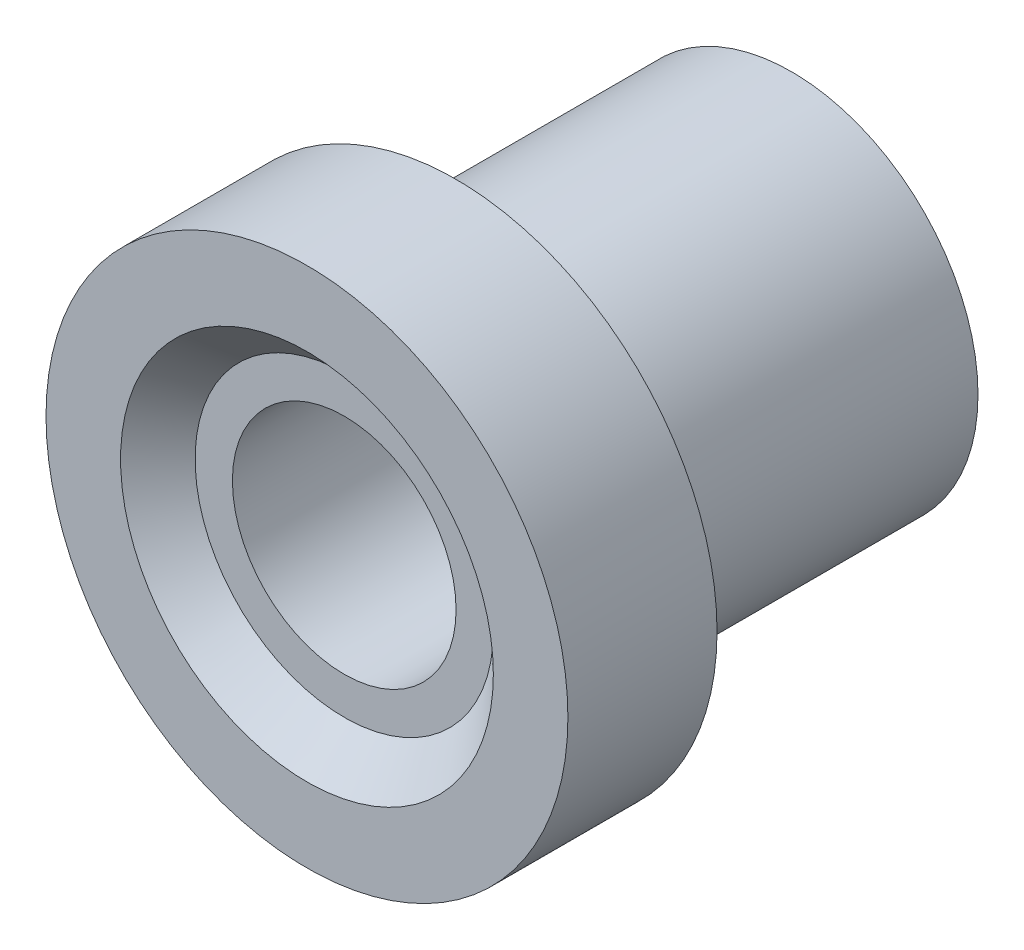
ISO-10303-21;
HEADER;
FILE_DESCRIPTION(('STEP AP214'),'2;1');
FILE_NAME('part.step','',(''),(''),'','','');
FILE_SCHEMA(('AUTOMOTIVE_DESIGN { 1 0 10303 214 1 1 1 1 }'));
ENDSEC;
DATA;
#1=APPLICATION_CONTEXT('core data for automotive mechanical design processes');
#2=APPLICATION_PROTOCOL_DEFINITION('international standard','automotive_design',2000,#1);
#3=PRODUCT_CONTEXT('',#1,'mechanical');
#4=PRODUCT('Part','Part','',(#3));
#5=PRODUCT_RELATED_PRODUCT_CATEGORY('part','',(#4));
#6=PRODUCT_DEFINITION_FORMATION('','',#4);
#7=PRODUCT_DEFINITION_CONTEXT('part definition',#1,'design');
#8=PRODUCT_DEFINITION('design','',#6,#7);
#9=PRODUCT_DEFINITION_SHAPE('','',#8);
#10=(LENGTH_UNIT() NAMED_UNIT(*) SI_UNIT(.MILLI.,.METRE.));
#11=(NAMED_UNIT(*) PLANE_ANGLE_UNIT() SI_UNIT($,.RADIAN.));
#12=(NAMED_UNIT(*) SI_UNIT($,.STERADIAN.) SOLID_ANGLE_UNIT());
#13=UNCERTAINTY_MEASURE_WITH_UNIT(LENGTH_MEASURE(1.E-05),#10,'distance_accuracy_value','');
#14=(GEOMETRIC_REPRESENTATION_CONTEXT(3) GLOBAL_UNCERTAINTY_ASSIGNED_CONTEXT((#13)) GLOBAL_UNIT_ASSIGNED_CONTEXT((#10,
#11,#12)) REPRESENTATION_CONTEXT('',''));
#15=CARTESIAN_POINT('',(0.,0.,0.));
#16=DIRECTION('',(0.,0.,1.));
#17=DIRECTION('',(1.,0.,0.));
#18=AXIS2_PLACEMENT_3D('',#15,#16,#17);
#19=CARTESIAN_POINT('',(-1.66533453693773E-13,0.,1000.));
#20=DIRECTION('',(0.,0.,1.));
#21=DIRECTION('',(1.,0.,0.));
#22=AXIS2_PLACEMENT_3D('',#19,#20,#21);
#23=CYLINDRICAL_SURFACE('',#22,7.);
#24=CARTESIAN_POINT('',(-2.77555756156289E-13,0.,4.));
#25=DIRECTION('',(0.,0.,1.));
#26=DIRECTION('',(1.,0.,0.));
#27=AXIS2_PLACEMENT_3D('',#24,#25,#26);
#28=CIRCLE('',#27,7.);
#29=CARTESIAN_POINT('',(6.99999999999973,0.,4.));
#30=VERTEX_POINT('',#29);
#31=EDGE_CURVE('E10',#30,#30,#28,.T.);
#32=ORIENTED_EDGE('',*,*,#31,.F.);
#33=EDGE_LOOP('',(#32));
#34=FACE_BOUND('',#33,.T.);
#35=CARTESIAN_POINT('',(0.,0.,0.));
#36=DIRECTION('',(0.,0.,1.));
#37=DIRECTION('',(1.,0.,0.));
#38=AXIS2_PLACEMENT_3D('',#35,#36,#37);
#39=CIRCLE('',#38,7.);
#40=CARTESIAN_POINT('',(7.00000000000001,0.,0.));
#41=VERTEX_POINT('',#40);
#42=EDGE_CURVE('E58',#41,#41,#39,.T.);
#43=ORIENTED_EDGE('',*,*,#42,.T.);
#44=EDGE_LOOP('',(#43));
#45=FACE_BOUND('',#44,.T.);
#46=ADVANCED_FACE('F30',(#34,#45),#23,.T.);
#47=CARTESIAN_POINT('',(-2.77555756156289E-13,7.00000000000001,4.));
#48=DIRECTION('',(0.,0.,-1.));
#49=DIRECTION('',(-1.,0.,0.));
#50=AXIS2_PLACEMENT_3D('',#47,#48,#49);
#51=PLANE('',#50);
#52=CARTESIAN_POINT('',(-2.77555756156289E-13,0.,4.));
#53=DIRECTION('',(0.,0.,1.));
#54=DIRECTION('',(1.,0.,0.));
#55=AXIS2_PLACEMENT_3D('',#52,#53,#54);
#56=CIRCLE('',#55,5.);
#57=CARTESIAN_POINT('',(4.99999999999973,0.,4.));
#58=VERTEX_POINT('',#57);
#59=EDGE_CURVE('E36',#58,#58,#56,.T.);
#60=ORIENTED_EDGE('',*,*,#59,.F.);
#61=EDGE_LOOP('',(#60));
#62=FACE_BOUND('',#61,.T.);
#63=ORIENTED_EDGE('',*,*,#31,.T.);
#64=EDGE_LOOP('',(#63));
#65=FACE_BOUND('',#64,.T.);
#66=ADVANCED_FACE('F95',(#62,#65),#51,.F.);
#67=CARTESIAN_POINT('',(-2.77555756156289E-13,0.,4.));
#68=DIRECTION('',(0.,0.,1.));
#69=DIRECTION('',(1.,0.,0.));
#70=AXIS2_PLACEMENT_3D('',#67,#68,#69);
#71=CONICAL_SURFACE('',#70,5.,0.785398163397448);
#72=CARTESIAN_POINT('',(-2.77555756156289E-13,0.,3.));
#73=DIRECTION('',(0.,0.,1.));
#74=DIRECTION('',(1.,0.,0.));
#75=AXIS2_PLACEMENT_3D('',#72,#73,#74);
#76=CIRCLE('',#75,4.);
#77=CARTESIAN_POINT('',(3.99999999999973,0.,3.));
#78=VERTEX_POINT('',#77);
#79=EDGE_CURVE('E40',#78,#78,#76,.T.);
#80=ORIENTED_EDGE('',*,*,#79,.F.);
#81=EDGE_LOOP('',(#80));
#82=FACE_BOUND('',#81,.T.);
#83=ORIENTED_EDGE('',*,*,#59,.T.);
#84=EDGE_LOOP('',(#83));
#85=FACE_BOUND('',#84,.T.);
#86=ADVANCED_FACE('F90',(#82,#85),#71,.F.);
#87=CARTESIAN_POINT('',(-2.77555756156289E-13,4.,3.));
#88=DIRECTION('',(0.,0.,-1.));
#89=DIRECTION('',(-1.,0.,0.));
#90=AXIS2_PLACEMENT_3D('',#87,#88,#89);
#91=PLANE('',#90);
#92=CARTESIAN_POINT('',(-2.77555756156289E-13,0.,3.));
#93=DIRECTION('',(0.,0.,1.));
#94=DIRECTION('',(1.,0.,0.));
#95=AXIS2_PLACEMENT_3D('',#92,#93,#94);
#96=CIRCLE('',#95,3.);
#97=CARTESIAN_POINT('',(2.99999999999973,0.,3.));
#98=VERTEX_POINT('',#97);
#99=EDGE_CURVE('E44',#98,#98,#96,.T.);
#100=ORIENTED_EDGE('',*,*,#99,.F.);
#101=EDGE_LOOP('',(#100));
#102=FACE_BOUND('',#101,.T.);
#103=ORIENTED_EDGE('',*,*,#79,.T.);
#104=EDGE_LOOP('',(#103));
#105=FACE_BOUND('',#104,.T.);
#106=ADVANCED_FACE('F84',(#102,#105),#91,.F.);
#107=CARTESIAN_POINT('',(-2.77555756156289E-13,0.,3.));
#108=DIRECTION('',(0.,0.,1.));
#109=DIRECTION('',(1.,0.,0.));
#110=AXIS2_PLACEMENT_3D('',#107,#108,#109);
#111=CONICAL_SURFACE('',#110,3.,0.000158336446844347);
#112=CARTESIAN_POINT('',(-1.11022302462516E-13,1.11022302462516E-13,-8.9999999999999));
#113=DIRECTION('',(0.,0.,1.));
#114=DIRECTION('',(1.,0.,0.));
#115=AXIS2_PLACEMENT_3D('',#112,#113,#114);
#116=CIRCLE('',#115,2.99809996262199);
#117=CARTESIAN_POINT('',(2.99809996262188,1.10966595591705E-13,-8.9999999999999));
#118=VERTEX_POINT('',#117);
#119=EDGE_CURVE('E49',#118,#118,#116,.T.);
#120=ORIENTED_EDGE('',*,*,#119,.F.);
#121=EDGE_LOOP('',(#120));
#122=FACE_BOUND('',#121,.T.);
#123=ORIENTED_EDGE('',*,*,#99,.T.);
#124=EDGE_LOOP('',(#123));
#125=FACE_BOUND('',#124,.T.);
#126=ADVANCED_FACE('F78',(#122,#125),#111,.F.);
#127=CARTESIAN_POINT('',(-1.11022302462516E-13,5.00000000000012,-8.99999999999999));
#128=DIRECTION('',(0.,0.,1.));
#129=DIRECTION('',(1.,0.,0.));
#130=AXIS2_PLACEMENT_3D('',#127,#128,#129);
#131=PLANE('',#130);
#132=CARTESIAN_POINT('',(-1.11022302462516E-13,1.11022302462516E-13,-8.9999999999999));
#133=DIRECTION('',(0.,0.,1.));
#134=DIRECTION('',(1.,0.,0.));
#135=AXIS2_PLACEMENT_3D('',#132,#133,#134);
#136=CIRCLE('',#135,5.);
#137=CARTESIAN_POINT('',(4.99999999999989,1.10929398837711E-13,-8.9999999999999));
#138=VERTEX_POINT('',#137);
#139=EDGE_CURVE('E52',#138,#138,#136,.T.);
#140=ORIENTED_EDGE('',*,*,#139,.F.);
#141=EDGE_LOOP('',(#140));
#142=FACE_BOUND('',#141,.T.);
#143=ORIENTED_EDGE('',*,*,#119,.T.);
#144=EDGE_LOOP('',(#143));
#145=FACE_BOUND('',#144,.T.);
#146=ADVANCED_FACE('F72',(#142,#145),#131,.F.);
#147=CARTESIAN_POINT('',(-1.66533453693773E-13,0.,1000.));
#148=DIRECTION('',(0.,0.,1.));
#149=DIRECTION('',(1.,0.,0.));
#150=AXIS2_PLACEMENT_3D('',#147,#148,#149);
#151=CYLINDRICAL_SURFACE('',#150,5.);
#152=CARTESIAN_POINT('',(0.,0.,0.));
#153=DIRECTION('',(0.,0.,1.));
#154=DIRECTION('',(1.,0.,0.));
#155=AXIS2_PLACEMENT_3D('',#152,#153,#154);
#156=CIRCLE('',#155,5.);
#157=CARTESIAN_POINT('',(5.,0.,0.));
#158=VERTEX_POINT('',#157);
#159=EDGE_CURVE('E55',#158,#158,#156,.T.);
#160=ORIENTED_EDGE('',*,*,#159,.F.);
#161=EDGE_LOOP('',(#160));
#162=FACE_BOUND('',#161,.T.);
#163=ORIENTED_EDGE('',*,*,#139,.T.);
#164=EDGE_LOOP('',(#163));
#165=FACE_BOUND('',#164,.T.);
#166=ADVANCED_FACE('F66',(#162,#165),#151,.T.);
#167=CARTESIAN_POINT('',(0.,7.00000000000001,0.));
#168=DIRECTION('',(0.,0.,1.));
#169=DIRECTION('',(1.,0.,0.));
#170=AXIS2_PLACEMENT_3D('',#167,#168,#169);
#171=PLANE('',#170);
#172=ORIENTED_EDGE('',*,*,#42,.F.);
#173=EDGE_LOOP('',(#172));
#174=FACE_BOUND('',#173,.T.);
#175=ORIENTED_EDGE('',*,*,#159,.T.);
#176=EDGE_LOOP('',(#175));
#177=FACE_BOUND('',#176,.T.);
#178=ADVANCED_FACE('F63',(#174,#177),#171,.F.);
#179=CLOSED_SHELL('',(#46,#66,#86,#106,#126,#146,#166,#178));
#180=MANIFOLD_SOLID_BREP('B2',#179);
#181=ADVANCED_BREP_SHAPE_REPRESENTATION('',(#18,#180),#14);
#182=SHAPE_DEFINITION_REPRESENTATION(#9,#181);
ENDSEC;
END-ISO-10303-21;
